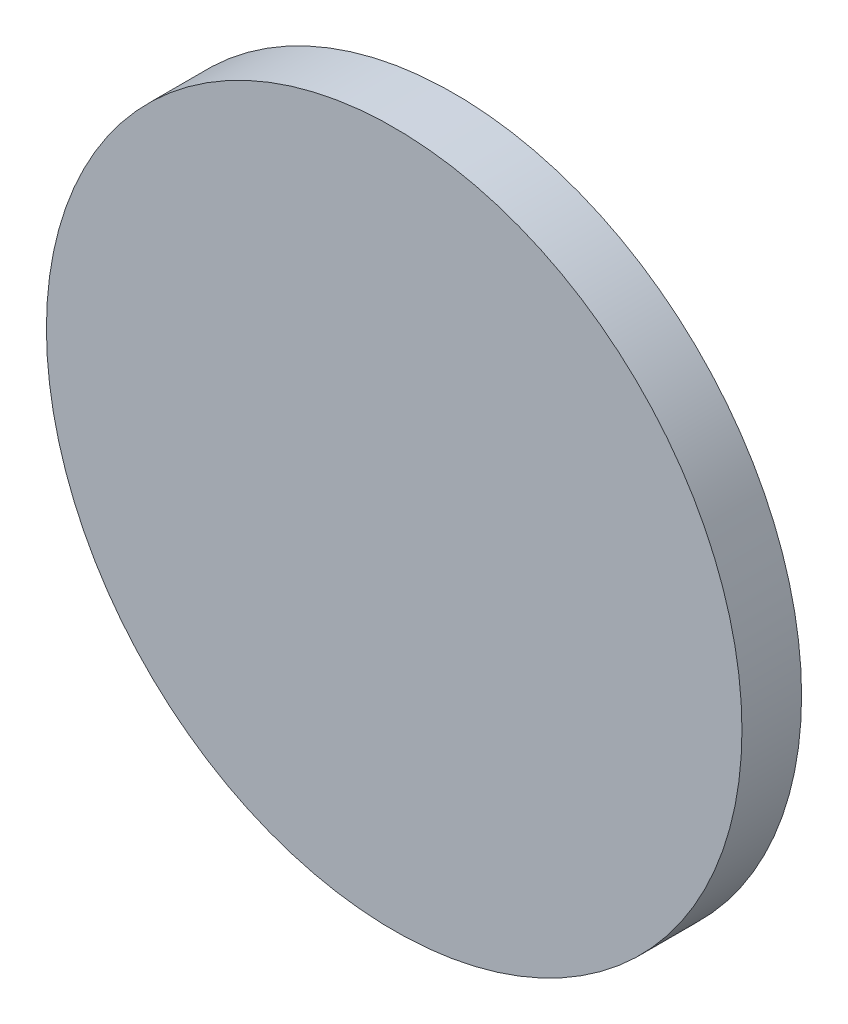
ISO-10303-21;
HEADER;
FILE_DESCRIPTION(('STEP AP214'),'2;1');
FILE_NAME('part.step','',(''),(''),'','','');
FILE_SCHEMA(('AUTOMOTIVE_DESIGN { 1 0 10303 214 1 1 1 1 }'));
ENDSEC;
DATA;
#1=APPLICATION_CONTEXT('core data for automotive mechanical design processes');
#2=APPLICATION_PROTOCOL_DEFINITION('international standard','automotive_design',2000,#1);
#3=PRODUCT_CONTEXT('',#1,'mechanical');
#4=PRODUCT('Part','Part','',(#3));
#5=PRODUCT_RELATED_PRODUCT_CATEGORY('part','',(#4));
#6=PRODUCT_DEFINITION_FORMATION('','',#4);
#7=PRODUCT_DEFINITION_CONTEXT('part definition',#1,'design');
#8=PRODUCT_DEFINITION('design','',#6,#7);
#9=PRODUCT_DEFINITION_SHAPE('','',#8);
#10=(LENGTH_UNIT() NAMED_UNIT(*) SI_UNIT(.MILLI.,.METRE.));
#11=(NAMED_UNIT(*) PLANE_ANGLE_UNIT() SI_UNIT($,.RADIAN.));
#12=(NAMED_UNIT(*) SI_UNIT($,.STERADIAN.) SOLID_ANGLE_UNIT());
#13=UNCERTAINTY_MEASURE_WITH_UNIT(LENGTH_MEASURE(1.E-05),#10,'distance_accuracy_value','');
#14=(GEOMETRIC_REPRESENTATION_CONTEXT(3) GLOBAL_UNCERTAINTY_ASSIGNED_CONTEXT((#13)) GLOBAL_UNIT_ASSIGNED_CONTEXT((#10,
#11,#12)) REPRESENTATION_CONTEXT('',''));
#15=CARTESIAN_POINT('',(0.,0.,0.));
#16=DIRECTION('',(0.,0.,1.));
#17=DIRECTION('',(1.,0.,0.));
#18=AXIS2_PLACEMENT_3D('',#15,#16,#17);
#19=CARTESIAN_POINT('',(5.3721,9.271,0.03429));
#20=DIRECTION('',(0.,0.,1.));
#21=DIRECTION('',(1.,0.,0.));
#22=AXIS2_PLACEMENT_3D('',#19,#20,#21);
#23=PLANE('',#22);
#24=CARTESIAN_POINT('',(5.3721,9.271,0.03429));
#25=DIRECTION('',(0.,0.,1.));
#26=DIRECTION('',(1.,0.,0.));
#27=AXIS2_PLACEMENT_3D('',#24,#25,#26);
#28=CIRCLE('',#27,0.200024667);
#29=CARTESIAN_POINT('',(5.572124667,9.271,0.03429));
#30=VERTEX_POINT('',#29);
#31=EDGE_CURVE('E18',#30,#30,#28,.F.);
#32=ORIENTED_EDGE('',*,*,#31,.F.);
#33=EDGE_LOOP('',(#32));
#34=FACE_BOUND('',#33,.T.);
#35=ADVANCED_FACE('F15',(#34),#23,.T.);
#36=CARTESIAN_POINT('',(5.3721,9.271,0.));
#37=DIRECTION('',(0.,0.,1.));
#38=DIRECTION('',(1.,0.,0.));
#39=AXIS2_PLACEMENT_3D('',#36,#37,#38);
#40=CYLINDRICAL_SURFACE('',#39,0.200024667);
#41=ORIENTED_EDGE('',*,*,#31,.T.);
#42=EDGE_LOOP('',(#41));
#43=FACE_BOUND('',#42,.T.);
#44=CARTESIAN_POINT('',(5.3721,9.271,0.));
#45=DIRECTION('',(0.,0.,1.));
#46=DIRECTION('',(1.,0.,0.));
#47=AXIS2_PLACEMENT_3D('',#44,#45,#46);
#48=CIRCLE('',#47,0.200024667);
#49=CARTESIAN_POINT('',(5.572124667,9.271,0.));
#50=VERTEX_POINT('',#49);
#51=EDGE_CURVE('E10',#50,#50,#48,.F.);
#52=ORIENTED_EDGE('',*,*,#51,.F.);
#53=EDGE_LOOP('',(#52));
#54=FACE_BOUND('',#53,.T.);
#55=ADVANCED_FACE('F27',(#43,#54),#40,.T.);
#56=CARTESIAN_POINT('',(5.3721,9.271,0.));
#57=DIRECTION('',(0.,0.,-1.));
#58=DIRECTION('',(-1.,0.,0.));
#59=AXIS2_PLACEMENT_3D('',#56,#57,#58);
#60=PLANE('',#59);
#61=ORIENTED_EDGE('',*,*,#51,.T.);
#62=EDGE_LOOP('',(#61));
#63=FACE_BOUND('',#62,.T.);
#64=ADVANCED_FACE('F35',(#63),#60,.T.);
#65=CLOSED_SHELL('',(#35,#55,#64));
#66=MANIFOLD_SOLID_BREP('B1',#65);
#67=ADVANCED_BREP_SHAPE_REPRESENTATION('',(#18,#66),#14);
#68=SHAPE_DEFINITION_REPRESENTATION(#9,#67);
ENDSEC;
END-ISO-10303-21;
